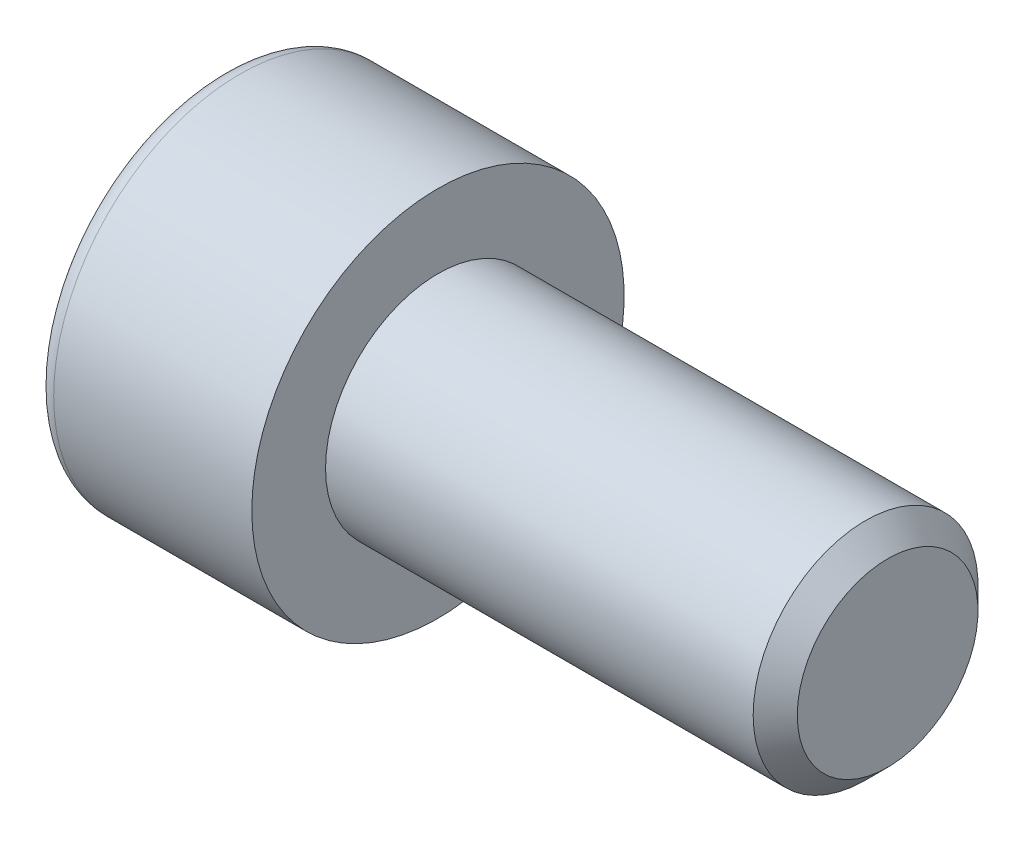
ISO-10303-21;
HEADER;
FILE_DESCRIPTION(('STEP AP214'),'2;1');
FILE_NAME('part.step','',(''),(''),'','','');
FILE_SCHEMA(('AUTOMOTIVE_DESIGN { 1 0 10303 214 1 1 1 1 }'));
ENDSEC;
DATA;
#1=APPLICATION_CONTEXT('core data for automotive mechanical design processes');
#2=APPLICATION_PROTOCOL_DEFINITION('international standard','automotive_design',2000,#1);
#3=PRODUCT_CONTEXT('',#1,'mechanical');
#4=PRODUCT('Part','Part','',(#3));
#5=PRODUCT_RELATED_PRODUCT_CATEGORY('part','',(#4));
#6=PRODUCT_DEFINITION_FORMATION('','',#4);
#7=PRODUCT_DEFINITION_CONTEXT('part definition',#1,'design');
#8=PRODUCT_DEFINITION('design','',#6,#7);
#9=PRODUCT_DEFINITION_SHAPE('','',#8);
#10=(LENGTH_UNIT() NAMED_UNIT(*) SI_UNIT(.MILLI.,.METRE.));
#11=(NAMED_UNIT(*) PLANE_ANGLE_UNIT() SI_UNIT($,.RADIAN.));
#12=(NAMED_UNIT(*) SI_UNIT($,.STERADIAN.) SOLID_ANGLE_UNIT());
#13=UNCERTAINTY_MEASURE_WITH_UNIT(LENGTH_MEASURE(1.E-05),#10,'distance_accuracy_value','');
#14=(GEOMETRIC_REPRESENTATION_CONTEXT(3) GLOBAL_UNCERTAINTY_ASSIGNED_CONTEXT((#13)) GLOBAL_UNIT_ASSIGNED_CONTEXT((#10,
#11,#12)) REPRESENTATION_CONTEXT('',''));
#15=CARTESIAN_POINT('',(0.,0.,0.));
#16=DIRECTION('',(0.,0.,1.));
#17=DIRECTION('',(1.,0.,0.));
#18=AXIS2_PLACEMENT_3D('',#15,#16,#17);
#19=CARTESIAN_POINT('',(0.,0.,0.));
#20=DIRECTION('',(-1.,0.,0.));
#21=DIRECTION('',(0.,0.,1.));
#22=AXIS2_PLACEMENT_3D('',#19,#20,#21);
#23=PLANE('',#22);
#24=CARTESIAN_POINT('',(0.,0.,0.));
#25=DIRECTION('',(-1.,0.,0.));
#26=DIRECTION('',(0.,0.,1.));
#27=AXIS2_PLACEMENT_3D('',#24,#25,#26);
#28=CIRCLE('',#27,4.14);
#29=CARTESIAN_POINT('',(0.,0.,4.14));
#30=VERTEX_POINT('',#29);
#31=EDGE_CURVE('E108',#30,#30,#28,.T.);
#32=ORIENTED_EDGE('',*,*,#31,.F.);
#33=EDGE_LOOP('',(#32));
#34=FACE_BOUND('',#33,.T.);
#35=CARTESIAN_POINT('',(0.,0.,0.));
#36=DIRECTION('',(-1.,0.,0.));
#37=DIRECTION('',(0.,0.,1.));
#38=AXIS2_PLACEMENT_3D('',#35,#36,#37);
#39=CIRCLE('',#38,2.5);
#40=CARTESIAN_POINT('',(0.,0.,2.5));
#41=VERTEX_POINT('',#40);
#42=EDGE_CURVE('E11',#41,#41,#39,.F.);
#43=ORIENTED_EDGE('',*,*,#42,.F.);
#44=EDGE_LOOP('',(#43));
#45=FACE_BOUND('',#44,.T.);
#46=ADVANCED_FACE('F16',(#34,#45),#23,.F.);
#47=CARTESIAN_POINT('',(-4.82,3.726,0.));
#48=DIRECTION('',(1.,0.,0.));
#49=DIRECTION('',(0.,0.,-1.));
#50=AXIS2_PLACEMENT_3D('',#47,#48,#49);
#51=PLANE('',#50);
#52=CARTESIAN_POINT('',(-4.82,0.,0.));
#53=DIRECTION('',(-1.,0.,0.));
#54=DIRECTION('',(0.,0.,1.));
#55=AXIS2_PLACEMENT_3D('',#52,#53,#54);
#56=CIRCLE('',#55,3.726);
#57=CARTESIAN_POINT('',(-4.82,0.,3.726));
#58=VERTEX_POINT('',#57);
#59=EDGE_CURVE('E91',#58,#58,#56,.T.);
#60=ORIENTED_EDGE('',*,*,#59,.T.);
#61=EDGE_LOOP('',(#60));
#62=FACE_BOUND('',#61,.T.);
#63=DIRECTION('',(0.,0.5,0.866025403784438));
#64=VECTOR('',#63,1.);
#65=CARTESIAN_POINT('',(-4.82,-0.800550807568874,2.61340532725041));
#66=LINE('',#65,#64);
#67=CARTESIAN_POINT('',(-4.82,-2.30940107675851,0.));
#68=VERTEX_POINT('',#67);
#69=CARTESIAN_POINT('',(-4.82,-1.15470053837925,2.));
#70=VERTEX_POINT('',#69);
#71=EDGE_CURVE('E25',#68,#70,#66,.T.);
#72=ORIENTED_EDGE('',*,*,#71,.F.);
#73=DIRECTION('',(0.,-0.5,0.866025403784439));
#74=VECTOR('',#73,1.);
#75=CARTESIAN_POINT('',(-4.82,-0.800550807568879,-2.61340532725041));
#76=LINE('',#75,#74);
#77=CARTESIAN_POINT('',(-4.82,-1.15470053837925,-2.));
#78=VERTEX_POINT('',#77);
#79=EDGE_CURVE('E40',#78,#68,#76,.T.);
#80=ORIENTED_EDGE('',*,*,#79,.F.);
#81=DIRECTION('',(0.,-1.,0.));
#82=VECTOR('',#81,1.);
#83=CARTESIAN_POINT('',(-4.82,3.726,-2.));
#84=LINE('',#83,#82);
#85=CARTESIAN_POINT('',(-4.82,1.15470053837925,-2.));
#86=VERTEX_POINT('',#85);
#87=EDGE_CURVE('E121',#86,#78,#84,.T.);
#88=ORIENTED_EDGE('',*,*,#87,.F.);
#89=DIRECTION('',(0.,-0.5,-0.866025403784439));
#90=VECTOR('',#89,1.);
#91=CARTESIAN_POINT('',(-4.82,2.66355080756888,0.613405327250409));
#92=LINE('',#91,#90);
#93=CARTESIAN_POINT('',(-4.82,2.30940107675851,0.));
#94=VERTEX_POINT('',#93);
#95=EDGE_CURVE('E118',#94,#86,#92,.T.);
#96=ORIENTED_EDGE('',*,*,#95,.F.);
#97=DIRECTION('',(0.,0.5,-0.866025403784439));
#98=VECTOR('',#97,1.);
#99=CARTESIAN_POINT('',(-4.82,2.66355080756888,-0.613405327250409));
#100=LINE('',#99,#98);
#101=CARTESIAN_POINT('',(-4.82,1.15470053837925,2.));
#102=VERTEX_POINT('',#101);
#103=EDGE_CURVE('E115',#102,#94,#100,.T.);
#104=ORIENTED_EDGE('',*,*,#103,.F.);
#105=DIRECTION('',(0.,1.,0.));
#106=VECTOR('',#105,1.);
#107=CARTESIAN_POINT('',(-4.82,3.726,2.));
#108=LINE('',#107,#106);
#109=EDGE_CURVE('E112',#70,#102,#108,.T.);
#110=ORIENTED_EDGE('',*,*,#109,.F.);
#111=EDGE_LOOP('',(#72,#80,#88,#96,#104,#110));
#112=FACE_BOUND('',#111,.T.);
#113=ADVANCED_FACE('F18',(#62,#112),#51,.F.);
#114=CARTESIAN_POINT('',(-4.82,0.,0.));
#115=DIRECTION('',(-1.,0.,0.));
#116=DIRECTION('',(0.,0.,1.));
#117=AXIS2_PLACEMENT_3D('',#114,#115,#116);
#118=CYLINDRICAL_SURFACE('',#117,4.14);
#119=CARTESIAN_POINT('',(-4.406,0.,0.));
#120=DIRECTION('',(-1.,0.,0.));
#121=DIRECTION('',(0.,0.,1.));
#122=AXIS2_PLACEMENT_3D('',#119,#120,#121);
#123=CIRCLE('',#122,4.14);
#124=CARTESIAN_POINT('',(-4.406,0.,4.14));
#125=VERTEX_POINT('',#124);
#126=EDGE_CURVE('E98',#125,#125,#123,.T.);
#127=ORIENTED_EDGE('',*,*,#126,.F.);
#128=EDGE_LOOP('',(#127));
#129=FACE_BOUND('',#128,.T.);
#130=ORIENTED_EDGE('',*,*,#31,.T.);
#131=EDGE_LOOP('',(#130));
#132=FACE_BOUND('',#131,.T.);
#133=ADVANCED_FACE('F202',(#129,#132),#118,.T.);
#134=CARTESIAN_POINT('',(-4.406,0.,0.));
#135=DIRECTION('',(-1.,0.,0.));
#136=DIRECTION('',(0.,0.,1.));
#137=AXIS2_PLACEMENT_3D('',#134,#135,#136);
#138=TOROIDAL_SURFACE('',#137,3.726,0.414);
#139=ORIENTED_EDGE('',*,*,#59,.F.);
#140=EDGE_LOOP('',(#139));
#141=FACE_BOUND('',#140,.T.);
#142=ORIENTED_EDGE('',*,*,#126,.T.);
#143=EDGE_LOOP('',(#142));
#144=FACE_BOUND('',#143,.T.);
#145=ADVANCED_FACE('F209',(#141,#144),#138,.T.);
#146=CARTESIAN_POINT('',(-2.32,-1.15470053837925,2.));
#147=DIRECTION('',(0.,0.866025403784438,-0.5));
#148=DIRECTION('',(0.,0.5,0.866025403784438));
#149=AXIS2_PLACEMENT_3D('',#146,#147,#148);
#150=PLANE('',#149);
#151=ORIENTED_EDGE('',*,*,#71,.T.);
#152=DIRECTION('',(-1.,0.,0.));
#153=VECTOR('',#152,1.);
#154=CARTESIAN_POINT('',(-2.32,-1.15470053837925,2.));
#155=LINE('',#154,#153);
#156=CARTESIAN_POINT('',(-2.32,-1.15470053837925,2.));
#157=VERTEX_POINT('',#156);
#158=EDGE_CURVE('E32',#157,#70,#155,.T.);
#159=ORIENTED_EDGE('',*,*,#158,.F.);
#160=DIRECTION('',(0.,-0.5,-0.866025403784439));
#161=VECTOR('',#160,1.);
#162=CARTESIAN_POINT('',(-2.32,-1.15470053837925,2.));
#163=LINE('',#162,#161);
#164=CARTESIAN_POINT('',(-2.32,-2.30940107675851,0.));
#165=VERTEX_POINT('',#164);
#166=EDGE_CURVE('E76',#157,#165,#163,.T.);
#167=ORIENTED_EDGE('',*,*,#166,.T.);
#168=DIRECTION('',(-1.,0.,0.));
#169=VECTOR('',#168,1.);
#170=CARTESIAN_POINT('',(-2.32,-2.30940107675851,0.));
#171=LINE('',#170,#169);
#172=EDGE_CURVE('E84',#165,#68,#171,.T.);
#173=ORIENTED_EDGE('',*,*,#172,.T.);
#174=EDGE_LOOP('',(#151,#159,#167,#173));
#175=FACE_BOUND('',#174,.T.);
#176=ADVANCED_FACE('F83',(#175),#150,.T.);
#177=CARTESIAN_POINT('',(-2.32,-2.30940107675851,0.));
#178=DIRECTION('',(0.,0.866025403784439,0.5));
#179=DIRECTION('',(0.,-0.5,0.866025403784439));
#180=AXIS2_PLACEMENT_3D('',#177,#178,#179);
#181=PLANE('',#180);
#182=ORIENTED_EDGE('',*,*,#79,.T.);
#183=ORIENTED_EDGE('',*,*,#172,.F.);
#184=DIRECTION('',(0.,0.5,-0.866025403784439));
#185=VECTOR('',#184,1.);
#186=CARTESIAN_POINT('',(-2.32,-2.30940107675851,0.));
#187=LINE('',#186,#185);
#188=CARTESIAN_POINT('',(-2.32,-1.15470053837925,-2.));
#189=VERTEX_POINT('',#188);
#190=EDGE_CURVE('E72',#165,#189,#187,.T.);
#191=ORIENTED_EDGE('',*,*,#190,.T.);
#192=DIRECTION('',(-1.,0.,0.));
#193=VECTOR('',#192,1.);
#194=CARTESIAN_POINT('',(-2.32,-1.15470053837925,-2.));
#195=LINE('',#194,#193);
#196=EDGE_CURVE('E92',#189,#78,#195,.T.);
#197=ORIENTED_EDGE('',*,*,#196,.T.);
#198=EDGE_LOOP('',(#182,#183,#191,#197));
#199=FACE_BOUND('',#198,.T.);
#200=ADVANCED_FACE('F89',(#199),#181,.T.);
#201=CARTESIAN_POINT('',(-2.32,-1.15470053837925,-2.));
#202=DIRECTION('',(0.,0.,1.));
#203=DIRECTION('',(0.,-1.,0.));
#204=AXIS2_PLACEMENT_3D('',#201,#202,#203);
#205=PLANE('',#204);
#206=ORIENTED_EDGE('',*,*,#87,.T.);
#207=ORIENTED_EDGE('',*,*,#196,.F.);
#208=DIRECTION('',(0.,1.,0.));
#209=VECTOR('',#208,1.);
#210=CARTESIAN_POINT('',(-2.32,-1.15470053837925,-2.));
#211=LINE('',#210,#209);
#212=CARTESIAN_POINT('',(-2.32,1.15470053837925,-2.));
#213=VERTEX_POINT('',#212);
#214=EDGE_CURVE('E78',#189,#213,#211,.T.);
#215=ORIENTED_EDGE('',*,*,#214,.T.);
#216=DIRECTION('',(-1.,0.,0.));
#217=VECTOR('',#216,1.);
#218=CARTESIAN_POINT('',(-2.32,1.15470053837925,-2.));
#219=LINE('',#218,#217);
#220=EDGE_CURVE('E101',#213,#86,#219,.T.);
#221=ORIENTED_EDGE('',*,*,#220,.T.);
#222=EDGE_LOOP('',(#206,#207,#215,#221));
#223=FACE_BOUND('',#222,.T.);
#224=ADVANCED_FACE('F160',(#223),#205,.T.);
#225=CARTESIAN_POINT('',(-2.32,1.15470053837925,-2.));
#226=DIRECTION('',(0.,-0.866025403784438,0.5));
#227=DIRECTION('',(0.,-0.5,-0.866025403784439));
#228=AXIS2_PLACEMENT_3D('',#225,#226,#227);
#229=PLANE('',#228);
#230=ORIENTED_EDGE('',*,*,#95,.T.);
#231=ORIENTED_EDGE('',*,*,#220,.F.);
#232=DIRECTION('',(0.,0.5,0.866025403784439));
#233=VECTOR('',#232,1.);
#234=CARTESIAN_POINT('',(-2.32,1.15470053837925,-2.));
#235=LINE('',#234,#233);
#236=CARTESIAN_POINT('',(-2.32,2.30940107675851,0.));
#237=VERTEX_POINT('',#236);
#238=EDGE_CURVE('E163',#213,#237,#235,.T.);
#239=ORIENTED_EDGE('',*,*,#238,.T.);
#240=DIRECTION('',(-1.,0.,0.));
#241=VECTOR('',#240,1.);
#242=CARTESIAN_POINT('',(-2.32,2.30940107675851,0.));
#243=LINE('',#242,#241);
#244=EDGE_CURVE('E142',#237,#94,#243,.T.);
#245=ORIENTED_EDGE('',*,*,#244,.T.);
#246=EDGE_LOOP('',(#230,#231,#239,#245));
#247=FACE_BOUND('',#246,.T.);
#248=ADVANCED_FACE('F162',(#247),#229,.T.);
#249=CARTESIAN_POINT('',(-2.32,2.30940107675851,0.));
#250=DIRECTION('',(0.,-0.866025403784439,-0.5));
#251=DIRECTION('',(0.,0.5,-0.866025403784439));
#252=AXIS2_PLACEMENT_3D('',#249,#250,#251);
#253=PLANE('',#252);
#254=ORIENTED_EDGE('',*,*,#103,.T.);
#255=ORIENTED_EDGE('',*,*,#244,.F.);
#256=DIRECTION('',(0.,-0.5,0.866025403784439));
#257=VECTOR('',#256,1.);
#258=CARTESIAN_POINT('',(-2.32,2.30940107675851,0.));
#259=LINE('',#258,#257);
#260=CARTESIAN_POINT('',(-2.32,1.15470053837925,2.));
#261=VERTEX_POINT('',#260);
#262=EDGE_CURVE('E140',#237,#261,#259,.T.);
#263=ORIENTED_EDGE('',*,*,#262,.T.);
#264=DIRECTION('',(-1.,0.,0.));
#265=VECTOR('',#264,1.);
#266=CARTESIAN_POINT('',(-2.32,1.15470053837925,2.));
#267=LINE('',#266,#265);
#268=EDGE_CURVE('E134',#261,#102,#267,.T.);
#269=ORIENTED_EDGE('',*,*,#268,.T.);
#270=EDGE_LOOP('',(#254,#255,#263,#269));
#271=FACE_BOUND('',#270,.T.);
#272=ADVANCED_FACE('F136',(#271),#253,.T.);
#273=CARTESIAN_POINT('',(-2.32,1.15470053837925,2.));
#274=DIRECTION('',(0.,0.,-1.));
#275=DIRECTION('',(0.,1.,0.));
#276=AXIS2_PLACEMENT_3D('',#273,#274,#275);
#277=PLANE('',#276);
#278=ORIENTED_EDGE('',*,*,#109,.T.);
#279=ORIENTED_EDGE('',*,*,#268,.F.);
#280=DIRECTION('',(0.,-1.,0.));
#281=VECTOR('',#280,1.);
#282=CARTESIAN_POINT('',(-2.32,1.15470053837925,2.));
#283=LINE('',#282,#281);
#284=EDGE_CURVE('E150',#261,#157,#283,.T.);
#285=ORIENTED_EDGE('',*,*,#284,.T.);
#286=ORIENTED_EDGE('',*,*,#158,.T.);
#287=EDGE_LOOP('',(#278,#279,#285,#286));
#288=FACE_BOUND('',#287,.T.);
#289=ADVANCED_FACE('F133',(#288),#277,.T.);
#290=CARTESIAN_POINT('',(-2.32,-2.30940107675851,0.));
#291=DIRECTION('',(1.,0.,0.));
#292=DIRECTION('',(0.,0.,1.));
#293=AXIS2_PLACEMENT_3D('',#290,#291,#292);
#294=PLANE('',#293);
#295=ORIENTED_EDGE('',*,*,#166,.F.);
#296=ORIENTED_EDGE('',*,*,#284,.F.);
#297=ORIENTED_EDGE('',*,*,#262,.F.);
#298=ORIENTED_EDGE('',*,*,#238,.F.);
#299=ORIENTED_EDGE('',*,*,#214,.F.);
#300=ORIENTED_EDGE('',*,*,#190,.F.);
#301=EDGE_LOOP('',(#295,#296,#297,#298,#299,#300));
#302=FACE_BOUND('',#301,.T.);
#303=ADVANCED_FACE('F74',(#302),#294,.F.);
#304=CARTESIAN_POINT('',(0.,0.,0.));
#305=DIRECTION('',(-1.,0.,0.));
#306=DIRECTION('',(0.,0.,1.));
#307=AXIS2_PLACEMENT_3D('',#304,#305,#306);
#308=CYLINDRICAL_SURFACE('',#307,2.5);
#309=CARTESIAN_POINT('',(9.5095,0.,0.));
#310=DIRECTION('',(-1.,0.,0.));
#311=DIRECTION('',(0.,0.,1.));
#312=AXIS2_PLACEMENT_3D('',#309,#310,#311);
#313=CIRCLE('',#312,2.5);
#314=CARTESIAN_POINT('',(9.5095,0.,2.5));
#315=VERTEX_POINT('',#314);
#316=EDGE_CURVE('E173',#315,#315,#313,.T.);
#317=ORIENTED_EDGE('',*,*,#316,.T.);
#318=EDGE_LOOP('',(#317));
#319=FACE_BOUND('',#318,.T.);
#320=ORIENTED_EDGE('',*,*,#42,.T.);
#321=EDGE_LOOP('',(#320));
#322=FACE_BOUND('',#321,.T.);
#323=ADVANCED_FACE('F179',(#319,#322),#308,.T.);
#324=CARTESIAN_POINT('',(10.,0.,0.));
#325=DIRECTION('',(-1.,0.,0.));
#326=DIRECTION('',(0.,0.,1.));
#327=AXIS2_PLACEMENT_3D('',#324,#325,#326);
#328=PLANE('',#327);
#329=CARTESIAN_POINT('',(10.,0.,0.));
#330=DIRECTION('',(-1.,0.,0.));
#331=DIRECTION('',(0.,0.,1.));
#332=AXIS2_PLACEMENT_3D('',#329,#330,#331);
#333=CIRCLE('',#332,2.0095);
#334=CARTESIAN_POINT('',(10.,0.,2.0095));
#335=VERTEX_POINT('',#334);
#336=EDGE_CURVE('E87',#335,#335,#333,.T.);
#337=ORIENTED_EDGE('',*,*,#336,.F.);
#338=EDGE_LOOP('',(#337));
#339=FACE_BOUND('',#338,.T.);
#340=ADVANCED_FACE('F185',(#339),#328,.F.);
#341=CARTESIAN_POINT('',(10.,0.,0.));
#342=DIRECTION('',(-1.,0.,0.));
#343=DIRECTION('',(0.,0.,1.));
#344=AXIS2_PLACEMENT_3D('',#341,#342,#343);
#345=CONICAL_SURFACE('',#344,2.0095,0.785398163397448);
#346=ORIENTED_EDGE('',*,*,#316,.F.);
#347=EDGE_LOOP('',(#346));
#348=FACE_BOUND('',#347,.T.);
#349=ORIENTED_EDGE('',*,*,#336,.T.);
#350=EDGE_LOOP('',(#349));
#351=FACE_BOUND('',#350,.T.);
#352=ADVANCED_FACE('F182',(#348,#351),#345,.T.);
#353=CLOSED_SHELL('',(#46,#113,#133,#145,#176,#200,#224,#248,#272,#289,#303,#323,#340,#352));
#354=MANIFOLD_SOLID_BREP('B1',#353);
#355=ADVANCED_BREP_SHAPE_REPRESENTATION('',(#18,#354),#14);
#356=SHAPE_DEFINITION_REPRESENTATION(#9,#355);
ENDSEC;
END-ISO-10303-21;
